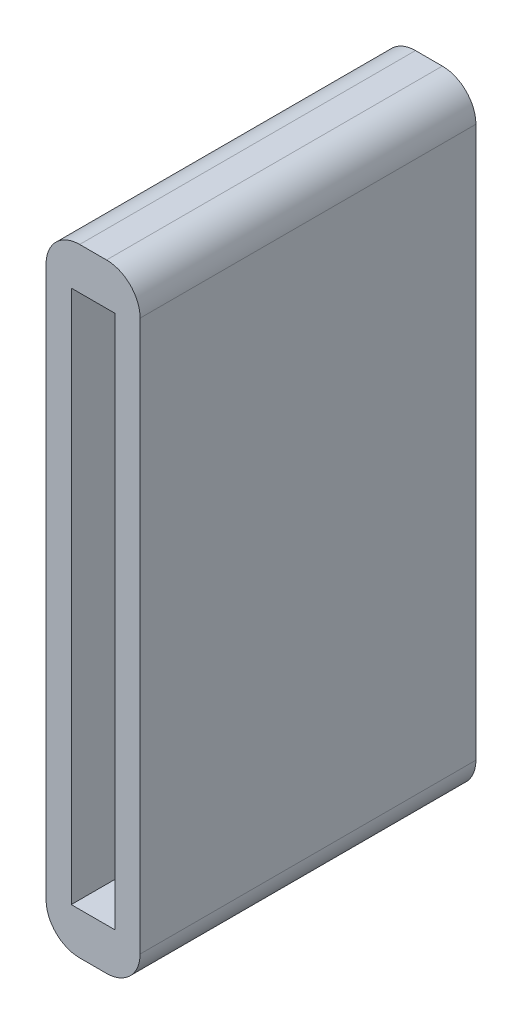
ISO-10303-21;
HEADER;
FILE_DESCRIPTION(('STEP AP214'),'2;1');
FILE_NAME('part.step','',(''),(''),'','','');
FILE_SCHEMA(('AUTOMOTIVE_DESIGN { 1 0 10303 214 1 1 1 1 }'));
ENDSEC;
DATA;
#1=APPLICATION_CONTEXT('core data for automotive mechanical design processes');
#2=APPLICATION_PROTOCOL_DEFINITION('international standard','automotive_design',2000,#1);
#3=PRODUCT_CONTEXT('',#1,'mechanical');
#4=PRODUCT('Part','Part','',(#3));
#5=PRODUCT_RELATED_PRODUCT_CATEGORY('part','',(#4));
#6=PRODUCT_DEFINITION_FORMATION('','',#4);
#7=PRODUCT_DEFINITION_CONTEXT('part definition',#1,'design');
#8=PRODUCT_DEFINITION('design','',#6,#7);
#9=PRODUCT_DEFINITION_SHAPE('','',#8);
#10=(LENGTH_UNIT() NAMED_UNIT(*) SI_UNIT(.MILLI.,.METRE.));
#11=(NAMED_UNIT(*) PLANE_ANGLE_UNIT() SI_UNIT($,.RADIAN.));
#12=(NAMED_UNIT(*) SI_UNIT($,.STERADIAN.) SOLID_ANGLE_UNIT());
#13=UNCERTAINTY_MEASURE_WITH_UNIT(LENGTH_MEASURE(1.E-05),#10,'distance_accuracy_value','');
#14=(GEOMETRIC_REPRESENTATION_CONTEXT(3) GLOBAL_UNCERTAINTY_ASSIGNED_CONTEXT((#13)) GLOBAL_UNIT_ASSIGNED_CONTEXT((#10,
#11,#12)) REPRESENTATION_CONTEXT('',''));
#15=CARTESIAN_POINT('',(0.,0.,0.));
#16=DIRECTION('',(0.,0.,1.));
#17=DIRECTION('',(1.,0.,0.));
#18=AXIS2_PLACEMENT_3D('',#15,#16,#17);
#19=CARTESIAN_POINT('',(0.,0.,20.));
#20=DIRECTION('',(0.,0.,-1.));
#21=DIRECTION('',(-1.,0.,0.));
#22=AXIS2_PLACEMENT_3D('',#19,#20,#21);
#23=PLANE('',#22);
#24=DIRECTION('',(0.,1.,0.));
#25=VECTOR('',#24,1.);
#26=CARTESIAN_POINT('',(2.98864961093405,-29.8384615384615,20.));
#27=LINE('',#26,#25);
#28=CARTESIAN_POINT('',(2.98864961093405,-27.8384615384615,20.));
#29=VERTEX_POINT('',#28);
#30=CARTESIAN_POINT('',(2.98864961093405,4.96153846153845,20.));
#31=VERTEX_POINT('',#30);
#32=EDGE_CURVE('E170',#29,#31,#27,.T.);
#33=ORIENTED_EDGE('',*,*,#32,.T.);
#34=CARTESIAN_POINT('',(0.988649610934051,4.96153846153845,20.));
#35=DIRECTION('',(0.,0.,-1.));
#36=DIRECTION('',(-1.,0.,0.));
#37=AXIS2_PLACEMENT_3D('',#34,#35,#36);
#38=CIRCLE('',#37,2.);
#39=CARTESIAN_POINT('',(0.988649610934055,6.96153846153845,20.));
#40=VERTEX_POINT('',#39);
#41=EDGE_CURVE('E208',#31,#40,#38,.F.);
#42=ORIENTED_EDGE('',*,*,#41,.T.);
#43=DIRECTION('',(-1.,0.,0.));
#44=VECTOR('',#43,1.);
#45=CARTESIAN_POINT('',(-2.61135038906596,6.96153846153846,20.));
#46=LINE('',#45,#44);
#47=CARTESIAN_POINT('',(-0.611350389065961,6.96153846153845,20.));
#48=VERTEX_POINT('',#47);
#49=EDGE_CURVE('E173',#40,#48,#46,.T.);
#50=ORIENTED_EDGE('',*,*,#49,.T.);
#51=CARTESIAN_POINT('',(-0.611350389065964,4.96153846153845,20.));
#52=DIRECTION('',(0.,0.,-1.));
#53=DIRECTION('',(-1.,0.,0.));
#54=AXIS2_PLACEMENT_3D('',#51,#52,#53);
#55=CIRCLE('',#54,2.);
#56=CARTESIAN_POINT('',(-2.61135038906596,4.96153846153845,20.));
#57=VERTEX_POINT('',#56);
#58=EDGE_CURVE('E203',#48,#57,#55,.F.);
#59=ORIENTED_EDGE('',*,*,#58,.T.);
#60=DIRECTION('',(0.,-1.,0.));
#61=VECTOR('',#60,1.);
#62=CARTESIAN_POINT('',(-2.61135038906596,-29.8384615384615,20.));
#63=LINE('',#62,#61);
#64=CARTESIAN_POINT('',(-2.61135038906596,-27.8384615384615,20.));
#65=VERTEX_POINT('',#64);
#66=EDGE_CURVE('E165',#57,#65,#63,.T.);
#67=ORIENTED_EDGE('',*,*,#66,.T.);
#68=CARTESIAN_POINT('',(-0.611350389065964,-27.8384615384615,20.));
#69=DIRECTION('',(0.,0.,-1.));
#70=DIRECTION('',(-1.,0.,0.));
#71=AXIS2_PLACEMENT_3D('',#68,#69,#70);
#72=CIRCLE('',#71,2.);
#73=CARTESIAN_POINT('',(-0.611350389065963,-29.8384615384615,20.));
#74=VERTEX_POINT('',#73);
#75=EDGE_CURVE('E55',#65,#74,#72,.F.);
#76=ORIENTED_EDGE('',*,*,#75,.T.);
#77=DIRECTION('',(1.,0.,0.));
#78=VECTOR('',#77,1.);
#79=CARTESIAN_POINT('',(-2.61135038906596,-29.8384615384615,20.));
#80=LINE('',#79,#78);
#81=CARTESIAN_POINT('',(0.988649610934052,-29.8384615384615,20.));
#82=VERTEX_POINT('',#81);
#83=EDGE_CURVE('E167',#74,#82,#80,.T.);
#84=ORIENTED_EDGE('',*,*,#83,.T.);
#85=CARTESIAN_POINT('',(0.988649610934051,-27.8384615384615,20.));
#86=DIRECTION('',(0.,0.,-1.));
#87=DIRECTION('',(-1.,0.,0.));
#88=AXIS2_PLACEMENT_3D('',#85,#86,#87);
#89=CIRCLE('',#88,2.);
#90=EDGE_CURVE('E206',#82,#29,#89,.F.);
#91=ORIENTED_EDGE('',*,*,#90,.T.);
#92=EDGE_LOOP('',(#33,#42,#50,#59,#67,#76,#84,#91));
#93=FACE_BOUND('',#92,.T.);
#94=DIRECTION('',(0.,-1.,0.));
#95=VECTOR('',#94,1.);
#96=CARTESIAN_POINT('',(-1.11135038906596,4.46153846153845,20.));
#97=LINE('',#96,#95);
#98=CARTESIAN_POINT('',(-1.11135038906596,4.46153846153845,20.));
#99=VERTEX_POINT('',#98);
#100=CARTESIAN_POINT('',(-1.11135038906596,-27.3384615384615,20.));
#101=VERTEX_POINT('',#100);
#102=EDGE_CURVE('E124',#99,#101,#97,.T.);
#103=ORIENTED_EDGE('',*,*,#102,.F.);
#104=DIRECTION('',(-1.,0.,0.));
#105=VECTOR('',#104,1.);
#106=CARTESIAN_POINT('',(-1.11135038906596,4.46153846153845,20.));
#107=LINE('',#106,#105);
#108=CARTESIAN_POINT('',(1.48864961093404,4.46153846153845,20.));
#109=VERTEX_POINT('',#108);
#110=EDGE_CURVE('E149',#109,#99,#107,.T.);
#111=ORIENTED_EDGE('',*,*,#110,.F.);
#112=DIRECTION('',(0.,1.,0.));
#113=VECTOR('',#112,1.);
#114=CARTESIAN_POINT('',(1.48864961093404,4.46153846153845,20.));
#115=LINE('',#114,#113);
#116=CARTESIAN_POINT('',(1.48864961093404,-27.3384615384615,20.));
#117=VERTEX_POINT('',#116);
#118=EDGE_CURVE('E147',#117,#109,#115,.T.);
#119=ORIENTED_EDGE('',*,*,#118,.F.);
#120=DIRECTION('',(1.,0.,0.));
#121=VECTOR('',#120,1.);
#122=CARTESIAN_POINT('',(-1.11135038906596,-27.3384615384615,20.));
#123=LINE('',#122,#121);
#124=EDGE_CURVE('E134',#101,#117,#123,.T.);
#125=ORIENTED_EDGE('',*,*,#124,.F.);
#126=EDGE_LOOP('',(#103,#111,#119,#125));
#127=FACE_BOUND('',#126,.T.);
#128=ADVANCED_FACE('F33',(#93,#127),#23,.F.);
#129=CARTESIAN_POINT('',(0.,0.,0.));
#130=DIRECTION('',(0.,0.,-1.));
#131=DIRECTION('',(-1.,0.,0.));
#132=AXIS2_PLACEMENT_3D('',#129,#130,#131);
#133=PLANE('',#132);
#134=DIRECTION('',(-1.,0.,0.));
#135=VECTOR('',#134,1.);
#136=CARTESIAN_POINT('',(-2.61135038906596,6.96153846153846,0.));
#137=LINE('',#136,#135);
#138=CARTESIAN_POINT('',(0.988649610934055,6.96153846153845,0.));
#139=VERTEX_POINT('',#138);
#140=CARTESIAN_POINT('',(-0.611350389065961,6.96153846153845,0.));
#141=VERTEX_POINT('',#140);
#142=EDGE_CURVE('E168',#139,#141,#137,.T.);
#143=ORIENTED_EDGE('',*,*,#142,.F.);
#144=CARTESIAN_POINT('',(0.988649610934051,4.96153846153845,0.));
#145=DIRECTION('',(0.,0.,-1.));
#146=DIRECTION('',(-1.,0.,0.));
#147=AXIS2_PLACEMENT_3D('',#144,#145,#146);
#148=CIRCLE('',#147,2.);
#149=CARTESIAN_POINT('',(2.98864961093405,4.96153846153845,0.));
#150=VERTEX_POINT('',#149);
#151=EDGE_CURVE('E196',#139,#150,#148,.T.);
#152=ORIENTED_EDGE('',*,*,#151,.T.);
#153=DIRECTION('',(0.,1.,0.));
#154=VECTOR('',#153,1.);
#155=CARTESIAN_POINT('',(2.98864961093405,-29.8384615384615,0.));
#156=LINE('',#155,#154);
#157=CARTESIAN_POINT('',(2.98864961093405,-27.8384615384615,0.));
#158=VERTEX_POINT('',#157);
#159=EDGE_CURVE('E181',#158,#150,#156,.T.);
#160=ORIENTED_EDGE('',*,*,#159,.F.);
#161=CARTESIAN_POINT('',(0.988649610934051,-27.8384615384615,0.));
#162=DIRECTION('',(0.,0.,-1.));
#163=DIRECTION('',(-1.,0.,0.));
#164=AXIS2_PLACEMENT_3D('',#161,#162,#163);
#165=CIRCLE('',#164,2.);
#166=CARTESIAN_POINT('',(0.988649610934052,-29.8384615384615,0.));
#167=VERTEX_POINT('',#166);
#168=EDGE_CURVE('E194',#158,#167,#165,.T.);
#169=ORIENTED_EDGE('',*,*,#168,.T.);
#170=DIRECTION('',(1.,0.,0.));
#171=VECTOR('',#170,1.);
#172=CARTESIAN_POINT('',(-2.61135038906596,-29.8384615384615,0.));
#173=LINE('',#172,#171);
#174=CARTESIAN_POINT('',(-0.611350389065963,-29.8384615384615,0.));
#175=VERTEX_POINT('',#174);
#176=EDGE_CURVE('E179',#175,#167,#173,.T.);
#177=ORIENTED_EDGE('',*,*,#176,.F.);
#178=CARTESIAN_POINT('',(-0.611350389065964,-27.8384615384615,0.));
#179=DIRECTION('',(0.,0.,-1.));
#180=DIRECTION('',(-1.,0.,0.));
#181=AXIS2_PLACEMENT_3D('',#178,#179,#180);
#182=CIRCLE('',#181,2.);
#183=CARTESIAN_POINT('',(-2.61135038906596,-27.8384615384615,0.));
#184=VERTEX_POINT('',#183);
#185=EDGE_CURVE('E192',#175,#184,#182,.T.);
#186=ORIENTED_EDGE('',*,*,#185,.T.);
#187=DIRECTION('',(0.,-1.,0.));
#188=VECTOR('',#187,1.);
#189=CARTESIAN_POINT('',(-2.61135038906596,-29.8384615384615,0.));
#190=LINE('',#189,#188);
#191=CARTESIAN_POINT('',(-2.61135038906596,4.96153846153845,0.));
#192=VERTEX_POINT('',#191);
#193=EDGE_CURVE('E142',#192,#184,#190,.T.);
#194=ORIENTED_EDGE('',*,*,#193,.F.);
#195=CARTESIAN_POINT('',(-0.611350389065964,4.96153846153845,0.));
#196=DIRECTION('',(0.,0.,-1.));
#197=DIRECTION('',(-1.,0.,0.));
#198=AXIS2_PLACEMENT_3D('',#195,#196,#197);
#199=CIRCLE('',#198,2.);
#200=EDGE_CURVE('E190',#192,#141,#199,.T.);
#201=ORIENTED_EDGE('',*,*,#200,.T.);
#202=EDGE_LOOP('',(#143,#152,#160,#169,#177,#186,#194,#201));
#203=FACE_BOUND('',#202,.T.);
#204=DIRECTION('',(-1.,0.,0.));
#205=VECTOR('',#204,1.);
#206=CARTESIAN_POINT('',(-1.11135038906596,4.46153846153845,0.));
#207=LINE('',#206,#205);
#208=CARTESIAN_POINT('',(1.48864961093404,4.46153846153845,0.));
#209=VERTEX_POINT('',#208);
#210=CARTESIAN_POINT('',(-1.11135038906596,4.46153846153845,0.));
#211=VERTEX_POINT('',#210);
#212=EDGE_CURVE('E135',#209,#211,#207,.T.);
#213=ORIENTED_EDGE('',*,*,#212,.T.);
#214=DIRECTION('',(0.,-1.,0.));
#215=VECTOR('',#214,1.);
#216=CARTESIAN_POINT('',(-1.11135038906596,4.46153846153845,0.));
#217=LINE('',#216,#215);
#218=CARTESIAN_POINT('',(-1.11135038906596,-27.3384615384615,0.));
#219=VERTEX_POINT('',#218);
#220=EDGE_CURVE('E153',#211,#219,#217,.T.);
#221=ORIENTED_EDGE('',*,*,#220,.T.);
#222=DIRECTION('',(1.,0.,0.));
#223=VECTOR('',#222,1.);
#224=CARTESIAN_POINT('',(-1.11135038906596,-27.3384615384615,0.));
#225=LINE('',#224,#223);
#226=CARTESIAN_POINT('',(1.48864961093404,-27.3384615384615,0.));
#227=VERTEX_POINT('',#226);
#228=EDGE_CURVE('E141',#219,#227,#225,.T.);
#229=ORIENTED_EDGE('',*,*,#228,.T.);
#230=DIRECTION('',(0.,1.,0.));
#231=VECTOR('',#230,1.);
#232=CARTESIAN_POINT('',(1.48864961093404,4.46153846153845,0.));
#233=LINE('',#232,#231);
#234=EDGE_CURVE('E156',#227,#209,#233,.T.);
#235=ORIENTED_EDGE('',*,*,#234,.T.);
#236=EDGE_LOOP('',(#213,#221,#229,#235));
#237=FACE_BOUND('',#236,.T.);
#238=ADVANCED_FACE('F224',(#203,#237),#133,.T.);
#239=CARTESIAN_POINT('',(-2.61135038906596,-29.8384615384615,20.));
#240=DIRECTION('',(1.,0.,0.));
#241=DIRECTION('',(0.,0.,-1.));
#242=AXIS2_PLACEMENT_3D('',#239,#240,#241);
#243=PLANE('',#242);
#244=ORIENTED_EDGE('',*,*,#193,.T.);
#245=DIRECTION('',(0.,0.,-1.));
#246=VECTOR('',#245,1.);
#247=CARTESIAN_POINT('',(-2.61135038906596,-27.8384615384615,20.));
#248=LINE('',#247,#246);
#249=EDGE_CURVE('E11',#184,#65,#248,.F.);
#250=ORIENTED_EDGE('',*,*,#249,.T.);
#251=ORIENTED_EDGE('',*,*,#66,.F.);
#252=DIRECTION('',(0.,0.,-1.));
#253=VECTOR('',#252,1.);
#254=CARTESIAN_POINT('',(-2.61135038906596,4.96153846153845,20.));
#255=LINE('',#254,#253);
#256=EDGE_CURVE('E41',#57,#192,#255,.T.);
#257=ORIENTED_EDGE('',*,*,#256,.T.);
#258=EDGE_LOOP('',(#244,#250,#251,#257));
#259=FACE_BOUND('',#258,.T.);
#260=ADVANCED_FACE('F218',(#259),#243,.F.);
#261=CARTESIAN_POINT('',(-2.61135038906596,-29.8384615384615,20.));
#262=DIRECTION('',(0.,1.,0.));
#263=DIRECTION('',(-1.,0.,0.));
#264=AXIS2_PLACEMENT_3D('',#261,#262,#263);
#265=PLANE('',#264);
#266=ORIENTED_EDGE('',*,*,#176,.T.);
#267=DIRECTION('',(0.,0.,-1.));
#268=VECTOR('',#267,1.);
#269=CARTESIAN_POINT('',(0.988649610934052,-29.8384615384615,20.));
#270=LINE('',#269,#268);
#271=EDGE_CURVE('E48',#167,#82,#270,.F.);
#272=ORIENTED_EDGE('',*,*,#271,.T.);
#273=ORIENTED_EDGE('',*,*,#83,.F.);
#274=DIRECTION('',(0.,0.,-1.));
#275=VECTOR('',#274,1.);
#276=CARTESIAN_POINT('',(-0.611350389065963,-29.8384615384615,20.));
#277=LINE('',#276,#275);
#278=EDGE_CURVE('E210',#74,#175,#277,.T.);
#279=ORIENTED_EDGE('',*,*,#278,.T.);
#280=EDGE_LOOP('',(#266,#272,#273,#279));
#281=FACE_BOUND('',#280,.T.);
#282=ADVANCED_FACE('F230',(#281),#265,.F.);
#283=CARTESIAN_POINT('',(2.98864961093405,-29.8384615384615,20.));
#284=DIRECTION('',(-1.,0.,0.));
#285=DIRECTION('',(0.,0.,1.));
#286=AXIS2_PLACEMENT_3D('',#283,#284,#285);
#287=PLANE('',#286);
#288=ORIENTED_EDGE('',*,*,#159,.T.);
#289=DIRECTION('',(0.,0.,-1.));
#290=VECTOR('',#289,1.);
#291=CARTESIAN_POINT('',(2.98864961093405,4.96153846153845,20.));
#292=LINE('',#291,#290);
#293=EDGE_CURVE('E201',#150,#31,#292,.F.);
#294=ORIENTED_EDGE('',*,*,#293,.T.);
#295=ORIENTED_EDGE('',*,*,#32,.F.);
#296=DIRECTION('',(0.,0.,-1.));
#297=VECTOR('',#296,1.);
#298=CARTESIAN_POINT('',(2.98864961093405,-27.8384615384615,20.));
#299=LINE('',#298,#297);
#300=EDGE_CURVE('E198',#29,#158,#299,.T.);
#301=ORIENTED_EDGE('',*,*,#300,.T.);
#302=EDGE_LOOP('',(#288,#294,#295,#301));
#303=FACE_BOUND('',#302,.T.);
#304=ADVANCED_FACE('F238',(#303),#287,.F.);
#305=CARTESIAN_POINT('',(-2.61135038906596,6.96153846153846,20.));
#306=DIRECTION('',(0.,-1.,0.));
#307=DIRECTION('',(1.,0.,0.));
#308=AXIS2_PLACEMENT_3D('',#305,#306,#307);
#309=PLANE('',#308);
#310=ORIENTED_EDGE('',*,*,#49,.F.);
#311=DIRECTION('',(0.,0.,-1.));
#312=VECTOR('',#311,1.);
#313=CARTESIAN_POINT('',(0.988649610934055,6.96153846153845,20.));
#314=LINE('',#313,#312);
#315=EDGE_CURVE('E187',#40,#139,#314,.T.);
#316=ORIENTED_EDGE('',*,*,#315,.T.);
#317=ORIENTED_EDGE('',*,*,#142,.T.);
#318=DIRECTION('',(0.,0.,-1.));
#319=VECTOR('',#318,1.);
#320=CARTESIAN_POINT('',(-0.611350389065961,6.96153846153845,20.));
#321=LINE('',#320,#319);
#322=EDGE_CURVE('E176',#141,#48,#321,.F.);
#323=ORIENTED_EDGE('',*,*,#322,.T.);
#324=EDGE_LOOP('',(#310,#316,#317,#323));
#325=FACE_BOUND('',#324,.T.);
#326=ADVANCED_FACE('F246',(#325),#309,.F.);
#327=CARTESIAN_POINT('',(-1.11135038906596,4.46153846153845,20.));
#328=DIRECTION('',(1.,0.,0.));
#329=DIRECTION('',(0.,0.,-1.));
#330=AXIS2_PLACEMENT_3D('',#327,#328,#329);
#331=PLANE('',#330);
#332=ORIENTED_EDGE('',*,*,#220,.F.);
#333=DIRECTION('',(0.,0.,-1.));
#334=VECTOR('',#333,1.);
#335=CARTESIAN_POINT('',(-1.11135038906596,4.46153846153845,20.));
#336=LINE('',#335,#334);
#337=EDGE_CURVE('E130',#99,#211,#336,.T.);
#338=ORIENTED_EDGE('',*,*,#337,.F.);
#339=ORIENTED_EDGE('',*,*,#102,.T.);
#340=DIRECTION('',(0.,0.,-1.));
#341=VECTOR('',#340,1.);
#342=CARTESIAN_POINT('',(-1.11135038906596,-27.3384615384615,20.));
#343=LINE('',#342,#341);
#344=EDGE_CURVE('E127',#101,#219,#343,.T.);
#345=ORIENTED_EDGE('',*,*,#344,.T.);
#346=EDGE_LOOP('',(#332,#338,#339,#345));
#347=FACE_BOUND('',#346,.T.);
#348=ADVANCED_FACE('F126',(#347),#331,.T.);
#349=CARTESIAN_POINT('',(-1.11135038906596,-27.3384615384615,20.));
#350=DIRECTION('',(0.,1.,0.));
#351=DIRECTION('',(0.,0.,1.));
#352=AXIS2_PLACEMENT_3D('',#349,#350,#351);
#353=PLANE('',#352);
#354=ORIENTED_EDGE('',*,*,#228,.F.);
#355=ORIENTED_EDGE('',*,*,#344,.F.);
#356=ORIENTED_EDGE('',*,*,#124,.T.);
#357=DIRECTION('',(0.,0.,-1.));
#358=VECTOR('',#357,1.);
#359=CARTESIAN_POINT('',(1.48864961093404,-27.3384615384615,20.));
#360=LINE('',#359,#358);
#361=EDGE_CURVE('E143',#117,#227,#360,.T.);
#362=ORIENTED_EDGE('',*,*,#361,.T.);
#363=EDGE_LOOP('',(#354,#355,#356,#362));
#364=FACE_BOUND('',#363,.T.);
#365=ADVANCED_FACE('F138',(#364),#353,.T.);
#366=CARTESIAN_POINT('',(1.48864961093404,4.46153846153845,20.));
#367=DIRECTION('',(-1.,0.,0.));
#368=DIRECTION('',(0.,0.,1.));
#369=AXIS2_PLACEMENT_3D('',#366,#367,#368);
#370=PLANE('',#369);
#371=ORIENTED_EDGE('',*,*,#234,.F.);
#372=ORIENTED_EDGE('',*,*,#361,.F.);
#373=ORIENTED_EDGE('',*,*,#118,.T.);
#374=DIRECTION('',(0.,0.,-1.));
#375=VECTOR('',#374,1.);
#376=CARTESIAN_POINT('',(1.48864961093404,4.46153846153845,20.));
#377=LINE('',#376,#375);
#378=EDGE_CURVE('E162',#109,#209,#377,.T.);
#379=ORIENTED_EDGE('',*,*,#378,.T.);
#380=EDGE_LOOP('',(#371,#372,#373,#379));
#381=FACE_BOUND('',#380,.T.);
#382=ADVANCED_FACE('F302',(#381),#370,.T.);
#383=CARTESIAN_POINT('',(-1.11135038906596,4.46153846153845,20.));
#384=DIRECTION('',(0.,-1.,0.));
#385=DIRECTION('',(0.,0.,-1.));
#386=AXIS2_PLACEMENT_3D('',#383,#384,#385);
#387=PLANE('',#386);
#388=ORIENTED_EDGE('',*,*,#212,.F.);
#389=ORIENTED_EDGE('',*,*,#378,.F.);
#390=ORIENTED_EDGE('',*,*,#110,.T.);
#391=ORIENTED_EDGE('',*,*,#337,.T.);
#392=EDGE_LOOP('',(#388,#389,#390,#391));
#393=FACE_BOUND('',#392,.T.);
#394=ADVANCED_FACE('F271',(#393),#387,.T.);
#395=CARTESIAN_POINT('',(0.988649610934051,4.96153846153845,20.));
#396=DIRECTION('',(0.,0.,-1.));
#397=DIRECTION('',(-1.,0.,0.));
#398=AXIS2_PLACEMENT_3D('',#395,#396,#397);
#399=CYLINDRICAL_SURFACE('',#398,2.);
#400=ORIENTED_EDGE('',*,*,#41,.F.);
#401=ORIENTED_EDGE('',*,*,#293,.F.);
#402=ORIENTED_EDGE('',*,*,#151,.F.);
#403=ORIENTED_EDGE('',*,*,#315,.F.);
#404=EDGE_LOOP('',(#400,#401,#402,#403));
#405=FACE_BOUND('',#404,.T.);
#406=ADVANCED_FACE('F243',(#405),#399,.T.);
#407=CARTESIAN_POINT('',(0.988649610934051,-27.8384615384615,20.));
#408=DIRECTION('',(0.,0.,-1.));
#409=DIRECTION('',(-1.,0.,0.));
#410=AXIS2_PLACEMENT_3D('',#407,#408,#409);
#411=CYLINDRICAL_SURFACE('',#410,2.);
#412=ORIENTED_EDGE('',*,*,#90,.F.);
#413=ORIENTED_EDGE('',*,*,#271,.F.);
#414=ORIENTED_EDGE('',*,*,#168,.F.);
#415=ORIENTED_EDGE('',*,*,#300,.F.);
#416=EDGE_LOOP('',(#412,#413,#414,#415));
#417=FACE_BOUND('',#416,.T.);
#418=ADVANCED_FACE('F235',(#417),#411,.T.);
#419=CARTESIAN_POINT('',(-0.611350389065964,-27.8384615384615,20.));
#420=DIRECTION('',(0.,0.,-1.));
#421=DIRECTION('',(-1.,0.,0.));
#422=AXIS2_PLACEMENT_3D('',#419,#420,#421);
#423=CYLINDRICAL_SURFACE('',#422,2.);
#424=ORIENTED_EDGE('',*,*,#75,.F.);
#425=ORIENTED_EDGE('',*,*,#249,.F.);
#426=ORIENTED_EDGE('',*,*,#185,.F.);
#427=ORIENTED_EDGE('',*,*,#278,.F.);
#428=EDGE_LOOP('',(#424,#425,#426,#427));
#429=FACE_BOUND('',#428,.T.);
#430=ADVANCED_FACE('F229',(#429),#423,.T.);
#431=CARTESIAN_POINT('',(-0.611350389065964,4.96153846153845,20.));
#432=DIRECTION('',(0.,0.,-1.));
#433=DIRECTION('',(-1.,0.,0.));
#434=AXIS2_PLACEMENT_3D('',#431,#432,#433);
#435=CYLINDRICAL_SURFACE('',#434,2.);
#436=ORIENTED_EDGE('',*,*,#58,.F.);
#437=ORIENTED_EDGE('',*,*,#322,.F.);
#438=ORIENTED_EDGE('',*,*,#200,.F.);
#439=ORIENTED_EDGE('',*,*,#256,.F.);
#440=EDGE_LOOP('',(#436,#437,#438,#439));
#441=FACE_BOUND('',#440,.T.);
#442=ADVANCED_FACE('F35',(#441),#435,.T.);
#443=CLOSED_SHELL('',(#128,#238,#260,#282,#304,#326,#348,#365,#382,#394,#406,#418,#430,#442));
#444=MANIFOLD_SOLID_BREP('B2',#443);
#445=ADVANCED_BREP_SHAPE_REPRESENTATION('',(#18,#444),#14);
#446=SHAPE_DEFINITION_REPRESENTATION(#9,#445);
ENDSEC;
END-ISO-10303-21;
